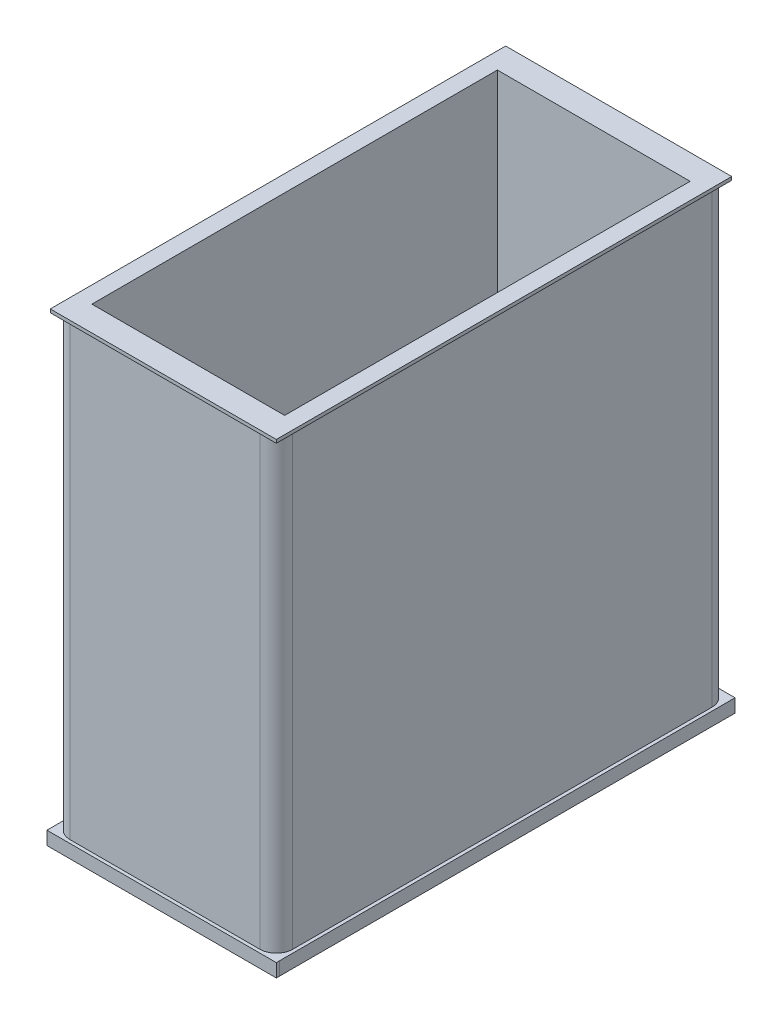
ISO-10303-21;
HEADER;
FILE_DESCRIPTION(('STEP AP214'),'2;1');
FILE_NAME('part.step','',(''),(''),'','','');
FILE_SCHEMA(('AUTOMOTIVE_DESIGN { 1 0 10303 214 1 1 1 1 }'));
ENDSEC;
DATA;
#1=APPLICATION_CONTEXT('core data for automotive mechanical design processes');
#2=APPLICATION_PROTOCOL_DEFINITION('international standard','automotive_design',2000,#1);
#3=PRODUCT_CONTEXT('',#1,'mechanical');
#4=PRODUCT('Part','Part','',(#3));
#5=PRODUCT_RELATED_PRODUCT_CATEGORY('part','',(#4));
#6=PRODUCT_DEFINITION_FORMATION('','',#4);
#7=PRODUCT_DEFINITION_CONTEXT('part definition',#1,'design');
#8=PRODUCT_DEFINITION('design','',#6,#7);
#9=PRODUCT_DEFINITION_SHAPE('','',#8);
#10=(LENGTH_UNIT() NAMED_UNIT(*) SI_UNIT(.MILLI.,.METRE.));
#11=(NAMED_UNIT(*) PLANE_ANGLE_UNIT() SI_UNIT($,.RADIAN.));
#12=(NAMED_UNIT(*) SI_UNIT($,.STERADIAN.) SOLID_ANGLE_UNIT());
#13=UNCERTAINTY_MEASURE_WITH_UNIT(LENGTH_MEASURE(1.E-05),#10,'distance_accuracy_value','');
#14=(GEOMETRIC_REPRESENTATION_CONTEXT(3) GLOBAL_UNCERTAINTY_ASSIGNED_CONTEXT((#13)) GLOBAL_UNIT_ASSIGNED_CONTEXT((#10,
#11,#12)) REPRESENTATION_CONTEXT('',''));
#15=CARTESIAN_POINT('',(0.,0.,0.));
#16=DIRECTION('',(0.,0.,1.));
#17=DIRECTION('',(1.,0.,0.));
#18=AXIS2_PLACEMENT_3D('',#15,#16,#17);
#19=CARTESIAN_POINT('',(-66.3338417235684,379.984,209.943981941993));
#20=DIRECTION('',(0.,0.,-1.));
#21=DIRECTION('',(-1.,0.,0.));
#22=AXIS2_PLACEMENT_3D('',#19,#20,#21);
#23=PLANE('',#22);
#24=DIRECTION('',(-1.,0.,0.));
#25=VECTOR('',#24,1.);
#26=CARTESIAN_POINT('',(-68.8738417235683,10.16,209.943981941993));
#27=LINE('',#26,#25);
#28=CARTESIAN_POINT('',(91.0521582764316,10.16,209.943981941993));
#29=VERTEX_POINT('',#28);
#30=CARTESIAN_POINT('',(-53.7938417235683,10.16,209.943981941993));
#31=VERTEX_POINT('',#30);
#32=EDGE_CURVE('E222',#29,#31,#27,.T.);
#33=ORIENTED_EDGE('',*,*,#32,.F.);
#34=DIRECTION('',(0.,-1.,0.));
#35=VECTOR('',#34,1.);
#36=CARTESIAN_POINT('',(91.0521582764316,379.984,209.943981941993));
#37=LINE('',#36,#35);
#38=CARTESIAN_POINT('',(91.0521582764316,352.044,209.943981941993));
#39=VERTEX_POINT('',#38);
#40=EDGE_CURVE('E61',#29,#39,#37,.F.);
#41=ORIENTED_EDGE('',*,*,#40,.T.);
#42=DIRECTION('',(1.,0.,0.));
#43=VECTOR('',#42,1.);
#44=CARTESIAN_POINT('',(-67.6038417235683,352.044,209.943981941993));
#45=LINE('',#44,#43);
#46=CARTESIAN_POINT('',(-53.7938417235683,352.044,209.943981941993));
#47=VERTEX_POINT('',#46);
#48=EDGE_CURVE('E261',#47,#39,#45,.T.);
#49=ORIENTED_EDGE('',*,*,#48,.F.);
#50=DIRECTION('',(0.,-1.,0.));
#51=VECTOR('',#50,1.);
#52=CARTESIAN_POINT('',(-53.7938417235683,379.984,209.943981941993));
#53=LINE('',#52,#51);
#54=EDGE_CURVE('E339',#47,#31,#53,.T.);
#55=ORIENTED_EDGE('',*,*,#54,.T.);
#56=EDGE_LOOP('',(#33,#41,#49,#55));
#57=FACE_BOUND('',#56,.T.);
#58=ADVANCED_FACE('F38',(#57),#23,.F.);
#59=CARTESIAN_POINT('',(-66.3338417235684,379.984,-134.988018058007));
#60=DIRECTION('',(1.,0.,0.));
#61=DIRECTION('',(0.,0.,-1.));
#62=AXIS2_PLACEMENT_3D('',#59,#60,#61);
#63=PLANE('',#62);
#64=DIRECTION('',(0.,0.,1.));
#65=VECTOR('',#64,1.);
#66=CARTESIAN_POINT('',(-66.3338417235684,352.044,-136.258018058007));
#67=LINE('',#66,#65);
#68=CARTESIAN_POINT('',(-66.3338417235684,352.044,-122.448018058007));
#69=VERTEX_POINT('',#68);
#70=CARTESIAN_POINT('',(-66.3338417235684,352.044,197.403981941993));
#71=VERTEX_POINT('',#70);
#72=EDGE_CURVE('E260',#69,#71,#67,.T.);
#73=ORIENTED_EDGE('',*,*,#72,.F.);
#74=DIRECTION('',(0.,-1.,0.));
#75=VECTOR('',#74,1.);
#76=CARTESIAN_POINT('',(-66.3338417235684,379.984,-122.448018058007));
#77=LINE('',#76,#75);
#78=CARTESIAN_POINT('',(-66.3338417235684,10.16,-122.448018058007));
#79=VERTEX_POINT('',#78);
#80=EDGE_CURVE('E335',#69,#79,#77,.T.);
#81=ORIENTED_EDGE('',*,*,#80,.T.);
#82=DIRECTION('',(0.,0.,-1.));
#83=VECTOR('',#82,1.);
#84=CARTESIAN_POINT('',(-66.3338417235684,10.16,-134.988018058007));
#85=LINE('',#84,#83);
#86=CARTESIAN_POINT('',(-66.3338417235684,10.16,197.403981941993));
#87=VERTEX_POINT('',#86);
#88=EDGE_CURVE('E316',#87,#79,#85,.T.);
#89=ORIENTED_EDGE('',*,*,#88,.F.);
#90=DIRECTION('',(0.,-1.,0.));
#91=VECTOR('',#90,1.);
#92=CARTESIAN_POINT('',(-66.3338417235684,379.984,197.403981941993));
#93=LINE('',#92,#91);
#94=EDGE_CURVE('E333',#87,#71,#93,.F.);
#95=ORIENTED_EDGE('',*,*,#94,.T.);
#96=EDGE_LOOP('',(#73,#81,#89,#95));
#97=FACE_BOUND('',#96,.T.);
#98=ADVANCED_FACE('F385',(#97),#63,.F.);
#99=CARTESIAN_POINT('',(-66.3338417235684,379.984,-134.988018058007));
#100=DIRECTION('',(0.,0.,1.));
#101=DIRECTION('',(1.,0.,0.));
#102=AXIS2_PLACEMENT_3D('',#99,#100,#101);
#103=PLANE('',#102);
#104=DIRECTION('',(-1.,0.,0.));
#105=VECTOR('',#104,1.);
#106=CARTESIAN_POINT('',(104.862158276432,352.044,-134.988018058007));
#107=LINE('',#106,#105);
#108=CARTESIAN_POINT('',(91.0521582764316,352.044,-134.988018058007));
#109=VERTEX_POINT('',#108);
#110=CARTESIAN_POINT('',(-53.7938417235684,352.044,-134.988018058007));
#111=VERTEX_POINT('',#110);
#112=EDGE_CURVE('E272',#109,#111,#107,.T.);
#113=ORIENTED_EDGE('',*,*,#112,.F.);
#114=DIRECTION('',(0.,-1.,0.));
#115=VECTOR('',#114,1.);
#116=CARTESIAN_POINT('',(91.0521582764316,379.984,-134.988018058007));
#117=LINE('',#116,#115);
#118=CARTESIAN_POINT('',(91.0521582764316,10.16,-134.988018058007));
#119=VERTEX_POINT('',#118);
#120=EDGE_CURVE('E325',#109,#119,#117,.T.);
#121=ORIENTED_EDGE('',*,*,#120,.T.);
#122=DIRECTION('',(1.,0.,0.));
#123=VECTOR('',#122,1.);
#124=CARTESIAN_POINT('',(106.132158276432,10.16,-134.988018058007));
#125=LINE('',#124,#123);
#126=CARTESIAN_POINT('',(-53.7938417235684,10.16,-134.988018058007));
#127=VERTEX_POINT('',#126);
#128=EDGE_CURVE('E264',#127,#119,#125,.T.);
#129=ORIENTED_EDGE('',*,*,#128,.F.);
#130=DIRECTION('',(0.,-1.,0.));
#131=VECTOR('',#130,1.);
#132=CARTESIAN_POINT('',(-53.7938417235684,379.984,-134.988018058007));
#133=LINE('',#132,#131);
#134=EDGE_CURVE('E263',#127,#111,#133,.F.);
#135=ORIENTED_EDGE('',*,*,#134,.T.);
#136=EDGE_LOOP('',(#113,#121,#129,#135));
#137=FACE_BOUND('',#136,.T.);
#138=ADVANCED_FACE('F376',(#137),#103,.F.);
#139=CARTESIAN_POINT('',(103.592158276432,379.984,-134.988018058007));
#140=DIRECTION('',(-1.,0.,0.));
#141=DIRECTION('',(0.,0.,1.));
#142=AXIS2_PLACEMENT_3D('',#139,#140,#141);
#143=PLANE('',#142);
#144=DIRECTION('',(0.,0.,1.));
#145=VECTOR('',#144,1.);
#146=CARTESIAN_POINT('',(103.592158276432,10.16,209.943981941993));
#147=LINE('',#146,#145);
#148=CARTESIAN_POINT('',(103.592158276432,10.16,-122.448018058007));
#149=VERTEX_POINT('',#148);
#150=CARTESIAN_POINT('',(103.592158276432,10.16,197.403981941993));
#151=VERTEX_POINT('',#150);
#152=EDGE_CURVE('E304',#149,#151,#147,.T.);
#153=ORIENTED_EDGE('',*,*,#152,.F.);
#154=DIRECTION('',(0.,-1.,0.));
#155=VECTOR('',#154,1.);
#156=CARTESIAN_POINT('',(103.592158276432,379.984,-122.448018058007));
#157=LINE('',#156,#155);
#158=CARTESIAN_POINT('',(103.592158276432,352.044,-122.448018058007));
#159=VERTEX_POINT('',#158);
#160=EDGE_CURVE('E331',#149,#159,#157,.F.);
#161=ORIENTED_EDGE('',*,*,#160,.T.);
#162=DIRECTION('',(0.,0.,-1.));
#163=VECTOR('',#162,1.);
#164=CARTESIAN_POINT('',(103.592158276432,352.044,209.943981941993));
#165=LINE('',#164,#163);
#166=CARTESIAN_POINT('',(103.592158276432,352.044,197.403981941993));
#167=VERTEX_POINT('',#166);
#168=EDGE_CURVE('E283',#167,#159,#165,.T.);
#169=ORIENTED_EDGE('',*,*,#168,.F.);
#170=DIRECTION('',(0.,-1.,0.));
#171=VECTOR('',#170,1.);
#172=CARTESIAN_POINT('',(103.592158276432,379.984,197.403981941993));
#173=LINE('',#172,#171);
#174=EDGE_CURVE('E328',#167,#151,#173,.T.);
#175=ORIENTED_EDGE('',*,*,#174,.T.);
#176=EDGE_LOOP('',(#153,#161,#169,#175));
#177=FACE_BOUND('',#176,.T.);
#178=ADVANCED_FACE('F368',(#177),#143,.F.);
#179=CARTESIAN_POINT('',(0.,0.,0.));
#180=DIRECTION('',(0.,1.,0.));
#181=DIRECTION('',(0.,0.,1.));
#182=AXIS2_PLACEMENT_3D('',#179,#180,#181);
#183=PLANE('',#182);
#184=DIRECTION('',(0.,0.,-1.));
#185=VECTOR('',#184,1.);
#186=CARTESIAN_POINT('',(106.132158276432,0.,209.943981941993));
#187=LINE('',#186,#185);
#188=CARTESIAN_POINT('',(106.132158276432,0.,209.943981941993));
#189=VERTEX_POINT('',#188);
#190=CARTESIAN_POINT('',(106.132158276432,0.,-137.528018058007));
#191=VERTEX_POINT('',#190);
#192=EDGE_CURVE('E311',#189,#191,#187,.T.);
#193=ORIENTED_EDGE('',*,*,#192,.F.);
#194=DIRECTION('',(1.,0.,0.));
#195=VECTOR('',#194,1.);
#196=CARTESIAN_POINT('',(-68.8738417235683,0.,209.943981941993));
#197=LINE('',#196,#195);
#198=CARTESIAN_POINT('',(106.141030732161,0.,209.943981941993));
#199=VERTEX_POINT('',#198);
#200=EDGE_CURVE('E241',#189,#199,#197,.T.);
#201=ORIENTED_EDGE('',*,*,#200,.T.);
#202=DIRECTION('',(0.,0.,-1.));
#203=VECTOR('',#202,1.);
#204=CARTESIAN_POINT('',(106.141030732161,0.,212.483981941993));
#205=LINE('',#204,#203);
#206=CARTESIAN_POINT('',(106.141030732161,0.,212.483981941993));
#207=VERTEX_POINT('',#206);
#208=EDGE_CURVE('E246',#207,#199,#205,.T.);
#209=ORIENTED_EDGE('',*,*,#208,.F.);
#210=DIRECTION('',(1.,0.,0.));
#211=VECTOR('',#210,1.);
#212=CARTESIAN_POINT('',(-68.8738417235683,0.,212.483981941993));
#213=LINE('',#212,#211);
#214=CARTESIAN_POINT('',(-68.8738417235683,0.,212.483981941993));
#215=VERTEX_POINT('',#214);
#216=EDGE_CURVE('E233',#215,#207,#213,.T.);
#217=ORIENTED_EDGE('',*,*,#216,.F.);
#218=DIRECTION('',(0.,0.,1.));
#219=VECTOR('',#218,1.);
#220=CARTESIAN_POINT('',(-68.8738417235684,0.,-134.988018058007));
#221=LINE('',#220,#219);
#222=CARTESIAN_POINT('',(-68.8738417235684,0.,-137.528018058007));
#223=VERTEX_POINT('',#222);
#224=EDGE_CURVE('E319',#223,#215,#221,.T.);
#225=ORIENTED_EDGE('',*,*,#224,.F.);
#226=DIRECTION('',(-1.,0.,0.));
#227=VECTOR('',#226,1.);
#228=CARTESIAN_POINT('',(106.132158276432,0.,-137.528018058007));
#229=LINE('',#228,#227);
#230=EDGE_CURVE('E295',#191,#223,#229,.T.);
#231=ORIENTED_EDGE('',*,*,#230,.F.);
#232=EDGE_LOOP('',(#193,#201,#209,#217,#225,#231));
#233=FACE_BOUND('',#232,.T.);
#234=ADVANCED_FACE('F459',(#233),#183,.F.);
#235=CARTESIAN_POINT('',(-68.8738417235684,10.16,-134.988018058007));
#236=DIRECTION('',(0.,-1.,0.));
#237=DIRECTION('',(0.,0.,-1.));
#238=AXIS2_PLACEMENT_3D('',#235,#236,#237);
#239=PLANE('',#238);
#240=ORIENTED_EDGE('',*,*,#32,.T.);
#241=CARTESIAN_POINT('',(-53.7938417235683,10.16,197.403981941993));
#242=DIRECTION('',(0.,-1.,0.));
#243=DIRECTION('',(0.,0.,-1.));
#244=AXIS2_PLACEMENT_3D('',#241,#242,#243);
#245=CIRCLE('',#244,12.54);
#246=EDGE_CURVE('E350',#31,#87,#245,.T.);
#247=ORIENTED_EDGE('',*,*,#246,.T.);
#248=ORIENTED_EDGE('',*,*,#88,.T.);
#249=CARTESIAN_POINT('',(-53.7938417235684,10.16,-122.448018058007));
#250=DIRECTION('',(0.,-1.,0.));
#251=DIRECTION('',(0.,0.,-1.));
#252=AXIS2_PLACEMENT_3D('',#249,#250,#251);
#253=CIRCLE('',#252,12.54);
#254=EDGE_CURVE('E346',#79,#127,#253,.T.);
#255=ORIENTED_EDGE('',*,*,#254,.T.);
#256=ORIENTED_EDGE('',*,*,#128,.T.);
#257=CARTESIAN_POINT('',(91.0521582764316,10.16,-122.448018058007));
#258=DIRECTION('',(0.,-1.,0.));
#259=DIRECTION('',(0.,0.,-1.));
#260=AXIS2_PLACEMENT_3D('',#257,#258,#259);
#261=CIRCLE('',#260,12.54);
#262=EDGE_CURVE('E342',#119,#149,#261,.T.);
#263=ORIENTED_EDGE('',*,*,#262,.T.);
#264=ORIENTED_EDGE('',*,*,#152,.T.);
#265=CARTESIAN_POINT('',(91.0521582764316,10.16,197.403981941993));
#266=DIRECTION('',(0.,-1.,0.));
#267=DIRECTION('',(0.,0.,-1.));
#268=AXIS2_PLACEMENT_3D('',#265,#266,#267);
#269=CIRCLE('',#268,12.54);
#270=EDGE_CURVE('E46',#151,#29,#269,.T.);
#271=ORIENTED_EDGE('',*,*,#270,.T.);
#272=EDGE_LOOP('',(#240,#247,#248,#255,#256,#263,#264,#271));
#273=FACE_BOUND('',#272,.T.);
#274=DIRECTION('',(0.,0.,-1.));
#275=VECTOR('',#274,1.);
#276=CARTESIAN_POINT('',(-68.8738417235684,10.16,-134.988018058007));
#277=LINE('',#276,#275);
#278=CARTESIAN_POINT('',(-68.8738417235683,10.16,212.483981941993));
#279=VERTEX_POINT('',#278);
#280=CARTESIAN_POINT('',(-68.8738417235684,10.16,-137.528018058007));
#281=VERTEX_POINT('',#280);
#282=EDGE_CURVE('E307',#279,#281,#277,.T.);
#283=ORIENTED_EDGE('',*,*,#282,.F.);
#284=DIRECTION('',(-1.,0.,0.));
#285=VECTOR('',#284,1.);
#286=CARTESIAN_POINT('',(-68.8738417235683,10.16,212.483981941993));
#287=LINE('',#286,#285);
#288=CARTESIAN_POINT('',(106.141030732161,10.16,212.483981941993));
#289=VERTEX_POINT('',#288);
#290=EDGE_CURVE('E226',#289,#279,#287,.T.);
#291=ORIENTED_EDGE('',*,*,#290,.F.);
#292=DIRECTION('',(0.,0.,-1.));
#293=VECTOR('',#292,1.);
#294=CARTESIAN_POINT('',(106.141030732161,10.16,212.483981941993));
#295=LINE('',#294,#293);
#296=CARTESIAN_POINT('',(106.141030732161,10.16,209.943981941993));
#297=VERTEX_POINT('',#296);
#298=EDGE_CURVE('E237',#289,#297,#295,.T.);
#299=ORIENTED_EDGE('',*,*,#298,.T.);
#300=CARTESIAN_POINT('',(106.132158276432,10.16,209.943981941993));
#301=VERTEX_POINT('',#300);
#302=EDGE_CURVE('E238',#297,#301,#27,.T.);
#303=ORIENTED_EDGE('',*,*,#302,.T.);
#304=DIRECTION('',(0.,0.,1.));
#305=VECTOR('',#304,1.);
#306=CARTESIAN_POINT('',(106.132158276432,10.16,209.943981941993));
#307=LINE('',#306,#305);
#308=CARTESIAN_POINT('',(106.132158276432,10.16,-137.528018058007));
#309=VERTEX_POINT('',#308);
#310=EDGE_CURVE('E313',#309,#301,#307,.T.);
#311=ORIENTED_EDGE('',*,*,#310,.F.);
#312=DIRECTION('',(1.,0.,0.));
#313=VECTOR('',#312,1.);
#314=CARTESIAN_POINT('',(106.132158276432,10.16,-137.528018058007));
#315=LINE('',#314,#313);
#316=EDGE_CURVE('E301',#281,#309,#315,.T.);
#317=ORIENTED_EDGE('',*,*,#316,.F.);
#318=EDGE_LOOP('',(#283,#291,#299,#303,#311,#317));
#319=FACE_BOUND('',#318,.T.);
#320=ADVANCED_FACE('F355',(#273,#319),#239,.F.);
#321=CARTESIAN_POINT('',(-68.8738417235684,0.,0.));
#322=DIRECTION('',(1.,0.,0.));
#323=DIRECTION('',(0.,0.,-1.));
#324=AXIS2_PLACEMENT_3D('',#321,#322,#323);
#325=PLANE('',#324);
#326=ORIENTED_EDGE('',*,*,#282,.T.);
#327=DIRECTION('',(0.,1.,0.));
#328=VECTOR('',#327,1.);
#329=CARTESIAN_POINT('',(-68.8738417235684,0.,-137.528018058007));
#330=LINE('',#329,#328);
#331=EDGE_CURVE('E298',#223,#281,#330,.T.);
#332=ORIENTED_EDGE('',*,*,#331,.F.);
#333=ORIENTED_EDGE('',*,*,#224,.T.);
#334=DIRECTION('',(0.,-1.,0.));
#335=VECTOR('',#334,1.);
#336=CARTESIAN_POINT('',(-68.8738417235683,10.16,212.483981941993));
#337=LINE('',#336,#335);
#338=EDGE_CURVE('E229',#279,#215,#337,.T.);
#339=ORIENTED_EDGE('',*,*,#338,.F.);
#340=EDGE_LOOP('',(#326,#332,#333,#339));
#341=FACE_BOUND('',#340,.T.);
#342=ADVANCED_FACE('F452',(#341),#325,.F.);
#343=CARTESIAN_POINT('',(106.132158276432,0.,0.));
#344=DIRECTION('',(-1.,0.,0.));
#345=DIRECTION('',(0.,0.,1.));
#346=AXIS2_PLACEMENT_3D('',#343,#344,#345);
#347=PLANE('',#346);
#348=DIRECTION('',(0.,-1.,0.));
#349=VECTOR('',#348,1.);
#350=CARTESIAN_POINT('',(106.132158276432,0.,209.943981941993));
#351=LINE('',#350,#349);
#352=EDGE_CURVE('E308',#301,#189,#351,.T.);
#353=ORIENTED_EDGE('',*,*,#352,.T.);
#354=ORIENTED_EDGE('',*,*,#192,.T.);
#355=DIRECTION('',(0.,-1.,0.));
#356=VECTOR('',#355,1.);
#357=CARTESIAN_POINT('',(106.132158276432,0.,-137.528018058007));
#358=LINE('',#357,#356);
#359=EDGE_CURVE('E290',#309,#191,#358,.T.);
#360=ORIENTED_EDGE('',*,*,#359,.F.);
#361=ORIENTED_EDGE('',*,*,#310,.T.);
#362=EDGE_LOOP('',(#353,#354,#360,#361));
#363=FACE_BOUND('',#362,.T.);
#364=ADVANCED_FACE('F448',(#363),#347,.F.);
#365=CARTESIAN_POINT('',(0.,0.,-137.528018058007));
#366=DIRECTION('',(0.,0.,1.));
#367=DIRECTION('',(1.,0.,0.));
#368=AXIS2_PLACEMENT_3D('',#365,#366,#367);
#369=PLANE('',#368);
#370=ORIENTED_EDGE('',*,*,#359,.T.);
#371=ORIENTED_EDGE('',*,*,#230,.T.);
#372=ORIENTED_EDGE('',*,*,#331,.T.);
#373=ORIENTED_EDGE('',*,*,#316,.T.);
#374=EDGE_LOOP('',(#370,#371,#372,#373));
#375=FACE_BOUND('',#374,.T.);
#376=ADVANCED_FACE('F445',(#375),#369,.F.);
#377=CARTESIAN_POINT('',(104.862158276432,352.044,209.943981941993));
#378=DIRECTION('',(0.,1.,0.));
#379=DIRECTION('',(0.,0.,1.));
#380=AXIS2_PLACEMENT_3D('',#377,#378,#379);
#381=PLANE('',#380);
#382=ORIENTED_EDGE('',*,*,#112,.T.);
#383=CARTESIAN_POINT('',(-53.7938417235684,352.044,-122.448018058007));
#384=DIRECTION('',(0.,1.,0.));
#385=DIRECTION('',(0.,0.,1.));
#386=AXIS2_PLACEMENT_3D('',#383,#384,#385);
#387=CIRCLE('',#386,12.54);
#388=EDGE_CURVE('E348',#111,#69,#387,.T.);
#389=ORIENTED_EDGE('',*,*,#388,.T.);
#390=ORIENTED_EDGE('',*,*,#72,.T.);
#391=CARTESIAN_POINT('',(-53.7938417235683,352.044,197.403981941993));
#392=DIRECTION('',(0.,1.,0.));
#393=DIRECTION('',(0.,0.,1.));
#394=AXIS2_PLACEMENT_3D('',#391,#392,#393);
#395=CIRCLE('',#394,12.54);
#396=EDGE_CURVE('E352',#71,#47,#395,.T.);
#397=ORIENTED_EDGE('',*,*,#396,.T.);
#398=ORIENTED_EDGE('',*,*,#48,.T.);
#399=CARTESIAN_POINT('',(91.0521582764316,352.044,197.403981941993));
#400=DIRECTION('',(0.,1.,0.));
#401=DIRECTION('',(0.,0.,1.));
#402=AXIS2_PLACEMENT_3D('',#399,#400,#401);
#403=CIRCLE('',#402,12.54);
#404=EDGE_CURVE('E11',#39,#167,#403,.T.);
#405=ORIENTED_EDGE('',*,*,#404,.T.);
#406=ORIENTED_EDGE('',*,*,#168,.T.);
#407=CARTESIAN_POINT('',(91.0521582764316,352.044,-122.448018058007));
#408=DIRECTION('',(0.,1.,0.));
#409=DIRECTION('',(0.,0.,1.));
#410=AXIS2_PLACEMENT_3D('',#407,#408,#409);
#411=CIRCLE('',#410,12.54);
#412=EDGE_CURVE('E344',#159,#109,#411,.T.);
#413=ORIENTED_EDGE('',*,*,#412,.T.);
#414=EDGE_LOOP('',(#382,#389,#390,#397,#398,#405,#406,#413));
#415=FACE_BOUND('',#414,.T.);
#416=DIRECTION('',(1.,0.,0.));
#417=VECTOR('',#416,1.);
#418=CARTESIAN_POINT('',(-67.6038417235683,352.044,211.213981941993));
#419=LINE('',#418,#417);
#420=CARTESIAN_POINT('',(-67.6038417235683,352.044,211.213981941993));
#421=VERTEX_POINT('',#420);
#422=CARTESIAN_POINT('',(104.862158276432,352.044,211.213981941993));
#423=VERTEX_POINT('',#422);
#424=EDGE_CURVE('E252',#421,#423,#419,.T.);
#425=ORIENTED_EDGE('',*,*,#424,.F.);
#426=DIRECTION('',(0.,0.,1.));
#427=VECTOR('',#426,1.);
#428=CARTESIAN_POINT('',(-67.6038417235684,352.044,-136.258018058007));
#429=LINE('',#428,#427);
#430=CARTESIAN_POINT('',(-67.6038417235684,352.044,-136.258018058007));
#431=VERTEX_POINT('',#430);
#432=EDGE_CURVE('E268',#431,#421,#429,.T.);
#433=ORIENTED_EDGE('',*,*,#432,.F.);
#434=DIRECTION('',(-1.,0.,0.));
#435=VECTOR('',#434,1.);
#436=CARTESIAN_POINT('',(104.862158276432,352.044,-136.258018058007));
#437=LINE('',#436,#435);
#438=CARTESIAN_POINT('',(104.862158276432,352.044,-136.258018058007));
#439=VERTEX_POINT('',#438);
#440=EDGE_CURVE('E278',#439,#431,#437,.T.);
#441=ORIENTED_EDGE('',*,*,#440,.F.);
#442=DIRECTION('',(0.,0.,-1.));
#443=VECTOR('',#442,1.);
#444=CARTESIAN_POINT('',(104.862158276432,352.044,209.943981941993));
#445=LINE('',#444,#443);
#446=EDGE_CURVE('E286',#423,#439,#445,.T.);
#447=ORIENTED_EDGE('',*,*,#446,.F.);
#448=EDGE_LOOP('',(#425,#433,#441,#447));
#449=FACE_BOUND('',#448,.T.);
#450=ADVANCED_FACE('F364',(#415,#449),#381,.F.);
#451=CARTESIAN_POINT('',(104.862158276432,354.584,209.943981941993));
#452=DIRECTION('',(0.,-1.,0.));
#453=DIRECTION('',(0.,0.,-1.));
#454=AXIS2_PLACEMENT_3D('',#451,#452,#453);
#455=PLANE('',#454);
#456=DIRECTION('',(1.,0.,0.));
#457=VECTOR('',#456,1.);
#458=CARTESIAN_POINT('',(-54.9038417235683,354.584,192.163981941993));
#459=LINE('',#458,#457);
#460=CARTESIAN_POINT('',(-54.9038417235683,354.584,192.163981941993));
#461=VERTEX_POINT('',#460);
#462=CARTESIAN_POINT('',(92.1621582764316,354.584,192.163981941993));
#463=VERTEX_POINT('',#462);
#464=EDGE_CURVE('E216',#461,#463,#459,.T.);
#465=ORIENTED_EDGE('',*,*,#464,.F.);
#466=DIRECTION('',(0.,0.,1.));
#467=VECTOR('',#466,1.);
#468=CARTESIAN_POINT('',(-54.9038417235683,354.584,-117.208018058007));
#469=LINE('',#468,#467);
#470=CARTESIAN_POINT('',(-54.9038417235683,354.584,-117.208018058007));
#471=VERTEX_POINT('',#470);
#472=EDGE_CURVE('E53',#471,#461,#469,.T.);
#473=ORIENTED_EDGE('',*,*,#472,.F.);
#474=DIRECTION('',(-1.,0.,0.));
#475=VECTOR('',#474,1.);
#476=CARTESIAN_POINT('',(-54.9038417235683,354.584,-117.208018058007));
#477=LINE('',#476,#475);
#478=CARTESIAN_POINT('',(92.1621582764316,354.584,-117.208018058007));
#479=VERTEX_POINT('',#478);
#480=EDGE_CURVE('E207',#479,#471,#477,.T.);
#481=ORIENTED_EDGE('',*,*,#480,.F.);
#482=DIRECTION('',(0.,0.,-1.));
#483=VECTOR('',#482,1.);
#484=CARTESIAN_POINT('',(92.1621582764316,354.584,-117.208018058007));
#485=LINE('',#484,#483);
#486=EDGE_CURVE('E210',#463,#479,#485,.T.);
#487=ORIENTED_EDGE('',*,*,#486,.F.);
#488=EDGE_LOOP('',(#465,#473,#481,#487));
#489=FACE_BOUND('',#488,.T.);
#490=DIRECTION('',(0.,0.,-1.));
#491=VECTOR('',#490,1.);
#492=CARTESIAN_POINT('',(-67.6038417235684,354.584,-136.258018058007));
#493=LINE('',#492,#491);
#494=CARTESIAN_POINT('',(-67.6038417235683,354.584,211.213981941993));
#495=VERTEX_POINT('',#494);
#496=CARTESIAN_POINT('',(-67.6038417235684,354.584,-136.258018058007));
#497=VERTEX_POINT('',#496);
#498=EDGE_CURVE('E270',#495,#497,#493,.T.);
#499=ORIENTED_EDGE('',*,*,#498,.F.);
#500=DIRECTION('',(-1.,0.,0.));
#501=VECTOR('',#500,1.);
#502=CARTESIAN_POINT('',(-67.6038417235683,354.584,211.213981941993));
#503=LINE('',#502,#501);
#504=CARTESIAN_POINT('',(104.862158276432,354.584,211.213981941993));
#505=VERTEX_POINT('',#504);
#506=EDGE_CURVE('E258',#505,#495,#503,.T.);
#507=ORIENTED_EDGE('',*,*,#506,.F.);
#508=DIRECTION('',(0.,0.,1.));
#509=VECTOR('',#508,1.);
#510=CARTESIAN_POINT('',(104.862158276432,354.584,209.943981941993));
#511=LINE('',#510,#509);
#512=CARTESIAN_POINT('',(104.862158276432,354.584,-136.258018058007));
#513=VERTEX_POINT('',#512);
#514=EDGE_CURVE('E288',#513,#505,#511,.T.);
#515=ORIENTED_EDGE('',*,*,#514,.F.);
#516=DIRECTION('',(1.,0.,0.));
#517=VECTOR('',#516,1.);
#518=CARTESIAN_POINT('',(104.862158276432,354.584,-136.258018058007));
#519=LINE('',#518,#517);
#520=EDGE_CURVE('E280',#497,#513,#519,.T.);
#521=ORIENTED_EDGE('',*,*,#520,.F.);
#522=EDGE_LOOP('',(#499,#507,#515,#521));
#523=FACE_BOUND('',#522,.T.);
#524=ADVANCED_FACE('F438',(#489,#523),#455,.F.);
#525=CARTESIAN_POINT('',(104.862158276432,0.,0.));
#526=DIRECTION('',(1.,0.,0.));
#527=DIRECTION('',(0.,0.,-1.));
#528=AXIS2_PLACEMENT_3D('',#525,#526,#527);
#529=PLANE('',#528);
#530=ORIENTED_EDGE('',*,*,#514,.T.);
#531=DIRECTION('',(0.,1.,0.));
#532=VECTOR('',#531,1.);
#533=CARTESIAN_POINT('',(104.862158276432,352.044,211.213981941993));
#534=LINE('',#533,#532);
#535=EDGE_CURVE('E255',#423,#505,#534,.T.);
#536=ORIENTED_EDGE('',*,*,#535,.F.);
#537=ORIENTED_EDGE('',*,*,#446,.T.);
#538=DIRECTION('',(0.,-1.,0.));
#539=VECTOR('',#538,1.);
#540=CARTESIAN_POINT('',(104.862158276432,352.044,-136.258018058007));
#541=LINE('',#540,#539);
#542=EDGE_CURVE('E275',#513,#439,#541,.T.);
#543=ORIENTED_EDGE('',*,*,#542,.F.);
#544=EDGE_LOOP('',(#530,#536,#537,#543));
#545=FACE_BOUND('',#544,.T.);
#546=ADVANCED_FACE('F434',(#545),#529,.T.);
#547=CARTESIAN_POINT('',(0.,0.,-136.258018058007));
#548=DIRECTION('',(0.,0.,1.));
#549=DIRECTION('',(1.,0.,0.));
#550=AXIS2_PLACEMENT_3D('',#547,#548,#549);
#551=PLANE('',#550);
#552=ORIENTED_EDGE('',*,*,#542,.T.);
#553=ORIENTED_EDGE('',*,*,#440,.T.);
#554=DIRECTION('',(0.,-1.,0.));
#555=VECTOR('',#554,1.);
#556=CARTESIAN_POINT('',(-67.6038417235684,352.044,-136.258018058007));
#557=LINE('',#556,#555);
#558=EDGE_CURVE('E265',#497,#431,#557,.T.);
#559=ORIENTED_EDGE('',*,*,#558,.F.);
#560=ORIENTED_EDGE('',*,*,#520,.T.);
#561=EDGE_LOOP('',(#552,#553,#559,#560));
#562=FACE_BOUND('',#561,.T.);
#563=ADVANCED_FACE('F430',(#562),#551,.F.);
#564=CARTESIAN_POINT('',(-67.6038417235684,0.,0.));
#565=DIRECTION('',(1.,0.,0.));
#566=DIRECTION('',(0.,0.,-1.));
#567=AXIS2_PLACEMENT_3D('',#564,#565,#566);
#568=PLANE('',#567);
#569=ORIENTED_EDGE('',*,*,#558,.T.);
#570=ORIENTED_EDGE('',*,*,#432,.T.);
#571=DIRECTION('',(0.,-1.,0.));
#572=VECTOR('',#571,1.);
#573=CARTESIAN_POINT('',(-67.6038417235683,352.044,211.213981941993));
#574=LINE('',#573,#572);
#575=EDGE_CURVE('E249',#495,#421,#574,.T.);
#576=ORIENTED_EDGE('',*,*,#575,.F.);
#577=ORIENTED_EDGE('',*,*,#498,.T.);
#578=EDGE_LOOP('',(#569,#570,#576,#577));
#579=FACE_BOUND('',#578,.T.);
#580=ADVANCED_FACE('F426',(#579),#568,.F.);
#581=CARTESIAN_POINT('',(0.,0.,211.213981941993));
#582=DIRECTION('',(0.,0.,-1.));
#583=DIRECTION('',(-1.,0.,0.));
#584=AXIS2_PLACEMENT_3D('',#581,#582,#583);
#585=PLANE('',#584);
#586=ORIENTED_EDGE('',*,*,#575,.T.);
#587=ORIENTED_EDGE('',*,*,#424,.T.);
#588=ORIENTED_EDGE('',*,*,#535,.T.);
#589=ORIENTED_EDGE('',*,*,#506,.T.);
#590=EDGE_LOOP('',(#586,#587,#588,#589));
#591=FACE_BOUND('',#590,.T.);
#592=ADVANCED_FACE('F402',(#591),#585,.F.);
#593=CARTESIAN_POINT('',(91.0521582764316,379.984,-122.448018058007));
#594=DIRECTION('',(0.,-1.,0.));
#595=DIRECTION('',(0.,0.,-1.));
#596=AXIS2_PLACEMENT_3D('',#593,#594,#595);
#597=CYLINDRICAL_SURFACE('',#596,12.54);
#598=ORIENTED_EDGE('',*,*,#412,.F.);
#599=ORIENTED_EDGE('',*,*,#160,.F.);
#600=ORIENTED_EDGE('',*,*,#262,.F.);
#601=ORIENTED_EDGE('',*,*,#120,.F.);
#602=EDGE_LOOP('',(#598,#599,#600,#601));
#603=FACE_BOUND('',#602,.T.);
#604=ADVANCED_FACE('F371',(#603),#597,.T.);
#605=CARTESIAN_POINT('',(-53.7938417235684,379.984,-122.448018058007));
#606=DIRECTION('',(0.,-1.,0.));
#607=DIRECTION('',(0.,0.,-1.));
#608=AXIS2_PLACEMENT_3D('',#605,#606,#607);
#609=CYLINDRICAL_SURFACE('',#608,12.54);
#610=ORIENTED_EDGE('',*,*,#388,.F.);
#611=ORIENTED_EDGE('',*,*,#134,.F.);
#612=ORIENTED_EDGE('',*,*,#254,.F.);
#613=ORIENTED_EDGE('',*,*,#80,.F.);
#614=EDGE_LOOP('',(#610,#611,#612,#613));
#615=FACE_BOUND('',#614,.T.);
#616=ADVANCED_FACE('F380',(#615),#609,.T.);
#617=CARTESIAN_POINT('',(-53.7938417235683,379.984,197.403981941993));
#618=DIRECTION('',(0.,-1.,0.));
#619=DIRECTION('',(0.,0.,-1.));
#620=AXIS2_PLACEMENT_3D('',#617,#618,#619);
#621=CYLINDRICAL_SURFACE('',#620,12.54);
#622=ORIENTED_EDGE('',*,*,#396,.F.);
#623=ORIENTED_EDGE('',*,*,#94,.F.);
#624=ORIENTED_EDGE('',*,*,#246,.F.);
#625=ORIENTED_EDGE('',*,*,#54,.F.);
#626=EDGE_LOOP('',(#622,#623,#624,#625));
#627=FACE_BOUND('',#626,.T.);
#628=ADVANCED_FACE('F389',(#627),#621,.T.);
#629=CARTESIAN_POINT('',(91.0521582764316,379.984,197.403981941993));
#630=DIRECTION('',(0.,-1.,0.));
#631=DIRECTION('',(0.,0.,-1.));
#632=AXIS2_PLACEMENT_3D('',#629,#630,#631);
#633=CYLINDRICAL_SURFACE('',#632,12.54);
#634=ORIENTED_EDGE('',*,*,#404,.F.);
#635=ORIENTED_EDGE('',*,*,#40,.F.);
#636=ORIENTED_EDGE('',*,*,#270,.F.);
#637=ORIENTED_EDGE('',*,*,#174,.F.);
#638=EDGE_LOOP('',(#634,#635,#636,#637));
#639=FACE_BOUND('',#638,.T.);
#640=ADVANCED_FACE('F40',(#639),#633,.T.);
#641=CARTESIAN_POINT('',(0.,0.,209.943981941993));
#642=DIRECTION('',(0.,0.,-1.));
#643=DIRECTION('',(-1.,0.,0.));
#644=AXIS2_PLACEMENT_3D('',#641,#642,#643);
#645=PLANE('',#644);
#646=ORIENTED_EDGE('',*,*,#352,.F.);
#647=ORIENTED_EDGE('',*,*,#302,.F.);
#648=DIRECTION('',(0.,1.,0.));
#649=VECTOR('',#648,1.);
#650=CARTESIAN_POINT('',(106.141030732161,10.16,209.943981941993));
#651=LINE('',#650,#649);
#652=EDGE_CURVE('E230',#199,#297,#651,.T.);
#653=ORIENTED_EDGE('',*,*,#652,.F.);
#654=ORIENTED_EDGE('',*,*,#200,.F.);
#655=EDGE_LOOP('',(#646,#647,#653,#654));
#656=FACE_BOUND('',#655,.T.);
#657=ADVANCED_FACE('F408',(#656),#645,.T.);
#658=CARTESIAN_POINT('',(106.141030732161,10.16,212.483981941993));
#659=DIRECTION('',(-1.,0.,0.));
#660=DIRECTION('',(0.,0.,1.));
#661=AXIS2_PLACEMENT_3D('',#658,#659,#660);
#662=PLANE('',#661);
#663=ORIENTED_EDGE('',*,*,#652,.T.);
#664=ORIENTED_EDGE('',*,*,#298,.F.);
#665=DIRECTION('',(0.,1.,0.));
#666=VECTOR('',#665,1.);
#667=CARTESIAN_POINT('',(106.141030732161,10.16,212.483981941993));
#668=LINE('',#667,#666);
#669=EDGE_CURVE('E235',#207,#289,#668,.T.);
#670=ORIENTED_EDGE('',*,*,#669,.F.);
#671=ORIENTED_EDGE('',*,*,#208,.T.);
#672=EDGE_LOOP('',(#663,#664,#670,#671));
#673=FACE_BOUND('',#672,.T.);
#674=ADVANCED_FACE('F412',(#673),#662,.F.);
#675=CARTESIAN_POINT('',(0.,0.,212.483981941993));
#676=DIRECTION('',(0.,0.,-1.));
#677=DIRECTION('',(-1.,0.,0.));
#678=AXIS2_PLACEMENT_3D('',#675,#676,#677);
#679=PLANE('',#678);
#680=ORIENTED_EDGE('',*,*,#290,.T.);
#681=ORIENTED_EDGE('',*,*,#338,.T.);
#682=ORIENTED_EDGE('',*,*,#216,.T.);
#683=ORIENTED_EDGE('',*,*,#669,.T.);
#684=EDGE_LOOP('',(#680,#681,#682,#683));
#685=FACE_BOUND('',#684,.T.);
#686=ADVANCED_FACE('F418',(#685),#679,.F.);
#687=CARTESIAN_POINT('',(-54.9038417235683,8.63600000000003,-117.208018058007));
#688=DIRECTION('',(-1.,0.,0.));
#689=DIRECTION('',(0.,0.,1.));
#690=AXIS2_PLACEMENT_3D('',#687,#688,#689);
#691=PLANE('',#690);
#692=ORIENTED_EDGE('',*,*,#472,.T.);
#693=DIRECTION('',(0.,1.,0.));
#694=VECTOR('',#693,1.);
#695=CARTESIAN_POINT('',(-54.9038417235683,8.63600000000003,192.163981941993));
#696=LINE('',#695,#694);
#697=CARTESIAN_POINT('',(-54.9038417235683,8.63600000000003,192.163981941993));
#698=VERTEX_POINT('',#697);
#699=EDGE_CURVE('E185',#698,#461,#696,.T.);
#700=ORIENTED_EDGE('',*,*,#699,.F.);
#701=DIRECTION('',(0.,0.,1.));
#702=VECTOR('',#701,1.);
#703=CARTESIAN_POINT('',(-54.9038417235683,8.63600000000003,-117.208018058007));
#704=LINE('',#703,#702);
#705=CARTESIAN_POINT('',(-54.9038417235683,8.63600000000003,-117.208018058007));
#706=VERTEX_POINT('',#705);
#707=EDGE_CURVE('E189',#706,#698,#704,.T.);
#708=ORIENTED_EDGE('',*,*,#707,.F.);
#709=DIRECTION('',(0.,1.,0.));
#710=VECTOR('',#709,1.);
#711=CARTESIAN_POINT('',(-54.9038417235683,8.63600000000003,-117.208018058007));
#712=LINE('',#711,#710);
#713=EDGE_CURVE('E220',#706,#471,#712,.T.);
#714=ORIENTED_EDGE('',*,*,#713,.T.);
#715=EDGE_LOOP('',(#692,#700,#708,#714));
#716=FACE_BOUND('',#715,.T.);
#717=ADVANCED_FACE('F187',(#716),#691,.F.);
#718=CARTESIAN_POINT('',(-54.9038417235683,8.63600000000003,-117.208018058007));
#719=DIRECTION('',(0.,0.,-1.));
#720=DIRECTION('',(-1.,0.,0.));
#721=AXIS2_PLACEMENT_3D('',#718,#719,#720);
#722=PLANE('',#721);
#723=ORIENTED_EDGE('',*,*,#480,.T.);
#724=ORIENTED_EDGE('',*,*,#713,.F.);
#725=DIRECTION('',(-1.,0.,0.));
#726=VECTOR('',#725,1.);
#727=CARTESIAN_POINT('',(-54.9038417235683,8.63600000000003,-117.208018058007));
#728=LINE('',#727,#726);
#729=CARTESIAN_POINT('',(92.1621582764316,8.63600000000003,-117.208018058007));
#730=VERTEX_POINT('',#729);
#731=EDGE_CURVE('E195',#730,#706,#728,.T.);
#732=ORIENTED_EDGE('',*,*,#731,.F.);
#733=DIRECTION('',(0.,1.,0.));
#734=VECTOR('',#733,1.);
#735=CARTESIAN_POINT('',(92.1621582764316,8.63600000000003,-117.208018058007));
#736=LINE('',#735,#734);
#737=EDGE_CURVE('E223',#730,#479,#736,.T.);
#738=ORIENTED_EDGE('',*,*,#737,.T.);
#739=EDGE_LOOP('',(#723,#724,#732,#738));
#740=FACE_BOUND('',#739,.T.);
#741=ADVANCED_FACE('F585',(#740),#722,.F.);
#742=CARTESIAN_POINT('',(92.1621582764316,8.63600000000003,-117.208018058007));
#743=DIRECTION('',(1.,0.,0.));
#744=DIRECTION('',(0.,0.,-1.));
#745=AXIS2_PLACEMENT_3D('',#742,#743,#744);
#746=PLANE('',#745);
#747=ORIENTED_EDGE('',*,*,#486,.T.);
#748=ORIENTED_EDGE('',*,*,#737,.F.);
#749=DIRECTION('',(0.,0.,-1.));
#750=VECTOR('',#749,1.);
#751=CARTESIAN_POINT('',(92.1621582764316,8.63600000000003,-117.208018058007));
#752=LINE('',#751,#750);
#753=CARTESIAN_POINT('',(92.1621582764316,8.63600000000003,192.163981941993));
#754=VERTEX_POINT('',#753);
#755=EDGE_CURVE('E203',#754,#730,#752,.T.);
#756=ORIENTED_EDGE('',*,*,#755,.F.);
#757=DIRECTION('',(0.,1.,0.));
#758=VECTOR('',#757,1.);
#759=CARTESIAN_POINT('',(92.1621582764316,8.63600000000003,192.163981941993));
#760=LINE('',#759,#758);
#761=EDGE_CURVE('E194',#754,#463,#760,.T.);
#762=ORIENTED_EDGE('',*,*,#761,.T.);
#763=EDGE_LOOP('',(#747,#748,#756,#762));
#764=FACE_BOUND('',#763,.T.);
#765=ADVANCED_FACE('F592',(#764),#746,.F.);
#766=CARTESIAN_POINT('',(-54.9038417235683,8.63600000000003,192.163981941993));
#767=DIRECTION('',(0.,0.,1.));
#768=DIRECTION('',(1.,0.,0.));
#769=AXIS2_PLACEMENT_3D('',#766,#767,#768);
#770=PLANE('',#769);
#771=ORIENTED_EDGE('',*,*,#464,.T.);
#772=ORIENTED_EDGE('',*,*,#761,.F.);
#773=DIRECTION('',(1.,0.,0.));
#774=VECTOR('',#773,1.);
#775=CARTESIAN_POINT('',(-54.9038417235683,8.63600000000003,192.163981941993));
#776=LINE('',#775,#774);
#777=EDGE_CURVE('E198',#698,#754,#776,.T.);
#778=ORIENTED_EDGE('',*,*,#777,.F.);
#779=ORIENTED_EDGE('',*,*,#699,.T.);
#780=EDGE_LOOP('',(#771,#772,#778,#779));
#781=FACE_BOUND('',#780,.T.);
#782=ADVANCED_FACE('F199',(#781),#770,.F.);
#783=CARTESIAN_POINT('',(0.,8.63600000000003,0.));
#784=DIRECTION('',(0.,1.,0.));
#785=DIRECTION('',(0.,0.,1.));
#786=AXIS2_PLACEMENT_3D('',#783,#784,#785);
#787=PLANE('',#786);
#788=ORIENTED_EDGE('',*,*,#707,.T.);
#789=ORIENTED_EDGE('',*,*,#777,.T.);
#790=ORIENTED_EDGE('',*,*,#755,.T.);
#791=ORIENTED_EDGE('',*,*,#731,.T.);
#792=EDGE_LOOP('',(#788,#789,#790,#791));
#793=FACE_BOUND('',#792,.T.);
#794=ADVANCED_FACE('F205',(#793),#787,.T.);
#795=CLOSED_SHELL('',(#58,#98,#138,#178,#234,#320,#342,#364,#376,#450,#524,#546,#563,#580,#592,
#604,#616,#628,#640,#657,#674,#686,#717,#741,#765,#782,#794));
#796=MANIFOLD_SOLID_BREP('B2',#795);
#797=ADVANCED_BREP_SHAPE_REPRESENTATION('',(#18,#796),#14);
#798=SHAPE_DEFINITION_REPRESENTATION(#9,#797);
ENDSEC;
END-ISO-10303-21;
